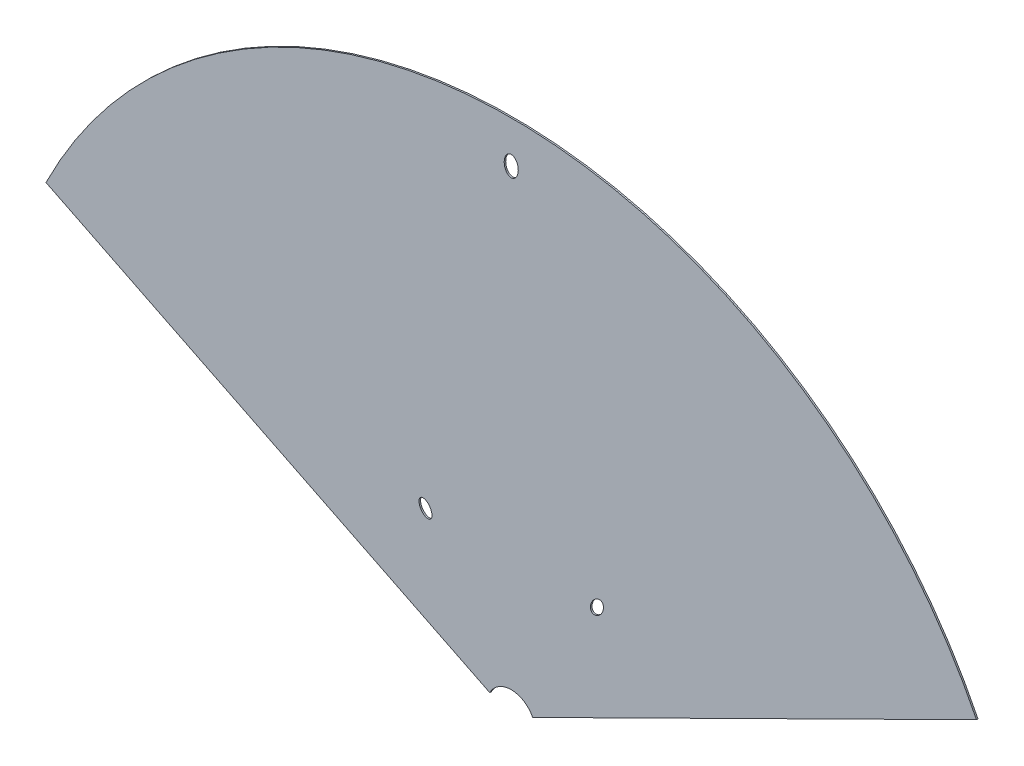
ISO-10303-21;
HEADER;
FILE_DESCRIPTION(('STEP AP214'),'2;1');
FILE_NAME('part.step','',(''),(''),'','','');
FILE_SCHEMA(('AUTOMOTIVE_DESIGN { 1 0 10303 214 1 1 1 1 }'));
ENDSEC;
DATA;
#1=APPLICATION_CONTEXT('core data for automotive mechanical design processes');
#2=APPLICATION_PROTOCOL_DEFINITION('international standard','automotive_design',2000,#1);
#3=PRODUCT_CONTEXT('',#1,'mechanical');
#4=PRODUCT('Part','Part','',(#3));
#5=PRODUCT_RELATED_PRODUCT_CATEGORY('part','',(#4));
#6=PRODUCT_DEFINITION_FORMATION('','',#4);
#7=PRODUCT_DEFINITION_CONTEXT('part definition',#1,'design');
#8=PRODUCT_DEFINITION('design','',#6,#7);
#9=PRODUCT_DEFINITION_SHAPE('','',#8);
#10=(LENGTH_UNIT() NAMED_UNIT(*) SI_UNIT(.MILLI.,.METRE.));
#11=(NAMED_UNIT(*) PLANE_ANGLE_UNIT() SI_UNIT($,.RADIAN.));
#12=(NAMED_UNIT(*) SI_UNIT($,.STERADIAN.) SOLID_ANGLE_UNIT());
#13=UNCERTAINTY_MEASURE_WITH_UNIT(LENGTH_MEASURE(1.E-05),#10,'distance_accuracy_value','');
#14=(GEOMETRIC_REPRESENTATION_CONTEXT(3) GLOBAL_UNCERTAINTY_ASSIGNED_CONTEXT((#13)) GLOBAL_UNIT_ASSIGNED_CONTEXT((#10,
#11,#12)) REPRESENTATION_CONTEXT('',''));
#15=CARTESIAN_POINT('',(0.,0.,0.));
#16=DIRECTION('',(0.,0.,1.));
#17=DIRECTION('',(1.,0.,0.));
#18=AXIS2_PLACEMENT_3D('',#15,#16,#17);
#19=CARTESIAN_POINT('',(98735.5249050137,8318.62947994032,5.));
#20=DIRECTION('',(0.,0.,1.));
#21=DIRECTION('',(1.,0.,0.));
#22=AXIS2_PLACEMENT_3D('',#19,#20,#21);
#23=CYLINDRICAL_SURFACE('',#22,1699.55627484778);
#24=DIRECTION('',(0.,0.,1.));
#25=VECTOR('',#24,1.);
#26=CARTESIAN_POINT('',(100258.364642478,9073.24903002874,5.));
#27=LINE('',#26,#25);
#28=CARTESIAN_POINT('',(100258.364642478,9073.24903002874,0.));
#29=VERTEX_POINT('',#28);
#30=CARTESIAN_POINT('',(100258.364642478,9073.24903002874,5.));
#31=VERTEX_POINT('',#30);
#32=EDGE_CURVE('E11',#29,#31,#27,.T.);
#33=ORIENTED_EDGE('',*,*,#32,.F.);
#34=CARTESIAN_POINT('',(98735.5249050137,8318.62947994032,0.));
#35=DIRECTION('',(0.,0.,1.));
#36=DIRECTION('',(1.,0.,0.));
#37=AXIS2_PLACEMENT_3D('',#34,#35,#36);
#38=CIRCLE('',#37,1699.55627484778);
#39=CARTESIAN_POINT('',(97212.6851675499,9073.24903002874,0.));
#40=VERTEX_POINT('',#39);
#41=EDGE_CURVE('E94',#29,#40,#38,.T.);
#42=ORIENTED_EDGE('',*,*,#41,.T.);
#43=DIRECTION('',(0.,0.,1.));
#44=VECTOR('',#43,1.);
#45=CARTESIAN_POINT('',(97212.6851675499,9073.24903002874,5.));
#46=LINE('',#45,#44);
#47=CARTESIAN_POINT('',(97212.6851675499,9073.24903002874,5.));
#48=VERTEX_POINT('',#47);
#49=EDGE_CURVE('E48',#40,#48,#46,.T.);
#50=ORIENTED_EDGE('',*,*,#49,.T.);
#51=CARTESIAN_POINT('',(98735.5249050137,8318.62947994032,5.));
#52=DIRECTION('',(0.,0.,1.));
#53=DIRECTION('',(1.,0.,0.));
#54=AXIS2_PLACEMENT_3D('',#51,#52,#53);
#55=CIRCLE('',#54,1699.55627484778);
#56=EDGE_CURVE('E114',#31,#48,#55,.T.);
#57=ORIENTED_EDGE('',*,*,#56,.F.);
#58=EDGE_LOOP('',(#33,#42,#50,#57));
#59=FACE_BOUND('',#58,.T.);
#60=ADVANCED_FACE('F37',(#59),#23,.T.);
#61=CARTESIAN_POINT('',(98665.3464000207,8353.40534673762,5.));
#62=DIRECTION('',(-0.444009746106229,-0.896021955848562,0.));
#63=DIRECTION('',(0.896021955848562,-0.444009746106229,0.));
#64=AXIS2_PLACEMENT_3D('',#61,#62,#63);
#65=PLANE('',#64);
#66=ORIENTED_EDGE('',*,*,#49,.F.);
#67=DIRECTION('',(0.896021955848562,-0.444009746106229,0.));
#68=VECTOR('',#67,1.);
#69=CARTESIAN_POINT('',(98665.3464000207,8353.40534673762,0.));
#70=LINE('',#69,#68);
#71=CARTESIAN_POINT('',(98665.3464000207,8353.40534673762,0.));
#72=VERTEX_POINT('',#71);
#73=EDGE_CURVE('E102',#40,#72,#70,.T.);
#74=ORIENTED_EDGE('',*,*,#73,.T.);
#75=DIRECTION('',(0.,0.,1.));
#76=VECTOR('',#75,1.);
#77=CARTESIAN_POINT('',(98665.3464000207,8353.40534673762,5.));
#78=LINE('',#77,#76);
#79=CARTESIAN_POINT('',(98665.3464000207,8353.40534673762,5.));
#80=VERTEX_POINT('',#79);
#81=EDGE_CURVE('E56',#72,#80,#78,.T.);
#82=ORIENTED_EDGE('',*,*,#81,.T.);
#83=DIRECTION('',(0.896021955848562,-0.444009746106229,0.));
#84=VECTOR('',#83,1.);
#85=CARTESIAN_POINT('',(98665.3464000207,8353.40534673762,5.));
#86=LINE('',#85,#84);
#87=EDGE_CURVE('E119',#48,#80,#86,.T.);
#88=ORIENTED_EDGE('',*,*,#87,.F.);
#89=EDGE_LOOP('',(#66,#74,#82,#88));
#90=FACE_BOUND('',#89,.T.);
#91=ADVANCED_FACE('F121',(#90),#65,.T.);
#92=CARTESIAN_POINT('',(98735.5249050137,8318.62947994032,5.));
#93=DIRECTION('',(0.,0.,-1.));
#94=DIRECTION('',(-1.,0.,0.));
#95=AXIS2_PLACEMENT_3D('',#92,#93,#94);
#96=CYLINDRICAL_SURFACE('',#95,78.3223050896136);
#97=ORIENTED_EDGE('',*,*,#81,.F.);
#98=CARTESIAN_POINT('',(98735.5249050137,8318.62947994032,0.));
#99=DIRECTION('',(0.,0.,-1.));
#100=DIRECTION('',(-1.,0.,0.));
#101=AXIS2_PLACEMENT_3D('',#98,#99,#100);
#102=CIRCLE('',#101,78.3223050896136);
#103=CARTESIAN_POINT('',(98805.7034100067,8353.40534673762,0.));
#104=VERTEX_POINT('',#103);
#105=EDGE_CURVE('E93',#72,#104,#102,.T.);
#106=ORIENTED_EDGE('',*,*,#105,.T.);
#107=DIRECTION('',(0.,0.,1.));
#108=VECTOR('',#107,1.);
#109=CARTESIAN_POINT('',(98805.7034100067,8353.40534673762,5.));
#110=LINE('',#109,#108);
#111=CARTESIAN_POINT('',(98805.7034100067,8353.40534673762,5.));
#112=VERTEX_POINT('',#111);
#113=EDGE_CURVE('E42',#104,#112,#110,.T.);
#114=ORIENTED_EDGE('',*,*,#113,.T.);
#115=CARTESIAN_POINT('',(98735.5249050137,8318.62947994032,5.));
#116=DIRECTION('',(0.,0.,-1.));
#117=DIRECTION('',(1.,0.,0.));
#118=AXIS2_PLACEMENT_3D('',#115,#116,#117);
#119=CIRCLE('',#118,78.3223050896136);
#120=EDGE_CURVE('E150',#80,#112,#119,.T.);
#121=ORIENTED_EDGE('',*,*,#120,.F.);
#122=EDGE_LOOP('',(#97,#106,#114,#121));
#123=FACE_BOUND('',#122,.T.);
#124=ADVANCED_FACE('F96',(#123),#96,.F.);
#125=CARTESIAN_POINT('',(99016.1931349281,8770.94837321438,5.));
#126=DIRECTION('',(0.,0.,1.));
#127=DIRECTION('',(0.52725243190216,0.849708698939382,0.));
#128=AXIS2_PLACEMENT_3D('',#125,#126,#127);
#129=ELLIPSE('',#128,27.9999999999978,18.0000000000058);
#130=DIRECTION('',(0.,0.,1.));
#131=VECTOR('',#130,1.);
#132=SURFACE_OF_LINEAR_EXTRUSION('',#129,#131);
#133=CARTESIAN_POINT('',(99030.9562030213,8794.74021678468,5.));
#134=VERTEX_POINT('',#133);
#135=EDGE_CURVE('E111',#134,#134,#129,.T.);
#136=ORIENTED_EDGE('',*,*,#135,.T.);
#137=EDGE_LOOP('',(#136));
#138=FACE_BOUND('',#137,.T.);
#139=CARTESIAN_POINT('',(99016.1931349281,8770.94837321438,0.));
#140=DIRECTION('',(0.,0.,1.));
#141=DIRECTION('',(0.52725243190216,0.849708698939382,0.));
#142=AXIS2_PLACEMENT_3D('',#139,#140,#141);
#143=ELLIPSE('',#142,27.9999999999978,18.0000000000058);
#144=CARTESIAN_POINT('',(99030.9562030213,8794.74021678468,0.));
#145=VERTEX_POINT('',#144);
#146=EDGE_CURVE('E97',#145,#145,#143,.T.);
#147=ORIENTED_EDGE('',*,*,#146,.F.);
#148=EDGE_LOOP('',(#147));
#149=FACE_BOUND('',#148,.T.);
#150=ADVANCED_FACE('F135',(#138,#149),#132,.F.);
#151=CARTESIAN_POINT('',(100258.364642478,9073.24903002874,5.));
#152=DIRECTION('',(0.444009746106232,-0.89602195584856,0.));
#153=DIRECTION('',(0.89602195584856,0.444009746106232,0.));
#154=AXIS2_PLACEMENT_3D('',#151,#152,#153);
#155=PLANE('',#154);
#156=DIRECTION('',(0.89602195584856,0.444009746106232,0.));
#157=VECTOR('',#156,1.);
#158=CARTESIAN_POINT('',(100258.364642478,9073.24903002874,0.));
#159=LINE('',#158,#157);
#160=EDGE_CURVE('E81',#104,#29,#159,.T.);
#161=ORIENTED_EDGE('',*,*,#160,.T.);
#162=ORIENTED_EDGE('',*,*,#32,.T.);
#163=DIRECTION('',(0.89602195584856,0.444009746106232,0.));
#164=VECTOR('',#163,1.);
#165=CARTESIAN_POINT('',(100258.364642478,9073.24903002874,5.));
#166=LINE('',#165,#164);
#167=EDGE_CURVE('E83',#112,#31,#166,.T.);
#168=ORIENTED_EDGE('',*,*,#167,.F.);
#169=ORIENTED_EDGE('',*,*,#113,.F.);
#170=EDGE_LOOP('',(#161,#162,#168,#169));
#171=FACE_BOUND('',#170,.T.);
#172=ADVANCED_FACE('F80',(#171),#155,.T.);
#173=CARTESIAN_POINT('',(98454.8566750993,8770.94837321438,5.));
#174=DIRECTION('',(0.,0.,1.));
#175=DIRECTION('',(-0.52725243190216,0.849708698939382,0.));
#176=AXIS2_PLACEMENT_3D('',#173,#174,#175);
#177=ELLIPSE('',#176,27.9999999999978,18.0000000000058);
#178=DIRECTION('',(0.,0.,1.));
#179=VECTOR('',#178,1.);
#180=SURFACE_OF_LINEAR_EXTRUSION('',#177,#179);
#181=CARTESIAN_POINT('',(98440.0936070061,8794.74021678468,5.));
#182=VERTEX_POINT('',#181);
#183=EDGE_CURVE('E122',#182,#182,#177,.T.);
#184=ORIENTED_EDGE('',*,*,#183,.T.);
#185=EDGE_LOOP('',(#184));
#186=FACE_BOUND('',#185,.T.);
#187=CARTESIAN_POINT('',(98454.8566750993,8770.94837321438,0.));
#188=DIRECTION('',(0.,0.,1.));
#189=DIRECTION('',(-0.52725243190216,0.849708698939382,0.));
#190=AXIS2_PLACEMENT_3D('',#187,#188,#189);
#191=ELLIPSE('',#190,27.9999999999978,18.0000000000058);
#192=CARTESIAN_POINT('',(98440.0936070061,8794.74021678468,0.));
#193=VERTEX_POINT('',#192);
#194=EDGE_CURVE('E104',#193,#193,#191,.T.);
#195=ORIENTED_EDGE('',*,*,#194,.F.);
#196=EDGE_LOOP('',(#195));
#197=FACE_BOUND('',#196,.T.);
#198=ADVANCED_FACE('F129',(#186,#197),#180,.F.);
#199=CARTESIAN_POINT('',(98735.5249050137,9881.1857547881,5.));
#200=DIRECTION('',(0.,0.,1.));
#201=DIRECTION('',(0.,1.,0.));
#202=AXIS2_PLACEMENT_3D('',#199,#200,#201);
#203=ELLIPSE('',#202,32.9999999999995,22.9999999999961);
#204=DIRECTION('',(0.,0.,1.));
#205=VECTOR('',#204,1.);
#206=SURFACE_OF_LINEAR_EXTRUSION('',#203,#205);
#207=CARTESIAN_POINT('',(98735.5249050137,9914.1857547881,5.));
#208=VERTEX_POINT('',#207);
#209=EDGE_CURVE('E87',#208,#208,#203,.T.);
#210=ORIENTED_EDGE('',*,*,#209,.T.);
#211=EDGE_LOOP('',(#210));
#212=FACE_BOUND('',#211,.T.);
#213=CARTESIAN_POINT('',(98735.5249050137,9881.1857547881,0.));
#214=DIRECTION('',(0.,0.,1.));
#215=DIRECTION('',(0.,1.,0.));
#216=AXIS2_PLACEMENT_3D('',#213,#214,#215);
#217=ELLIPSE('',#216,32.9999999999995,22.9999999999961);
#218=CARTESIAN_POINT('',(98735.5249050137,9914.1857547881,0.));
#219=VERTEX_POINT('',#218);
#220=EDGE_CURVE('E108',#219,#219,#217,.T.);
#221=ORIENTED_EDGE('',*,*,#220,.F.);
#222=EDGE_LOOP('',(#221));
#223=FACE_BOUND('',#222,.T.);
#224=ADVANCED_FACE('F39',(#212,#223),#206,.F.);
#225=CARTESIAN_POINT('',(98735.5249050137,8318.62947994032,5.));
#226=DIRECTION('',(0.,0.,1.));
#227=DIRECTION('',(1.,0.,0.));
#228=AXIS2_PLACEMENT_3D('',#225,#226,#227);
#229=PLANE('',#228);
#230=ORIENTED_EDGE('',*,*,#135,.F.);
#231=EDGE_LOOP('',(#230));
#232=FACE_BOUND('',#231,.T.);
#233=ORIENTED_EDGE('',*,*,#120,.T.);
#234=ORIENTED_EDGE('',*,*,#167,.T.);
#235=ORIENTED_EDGE('',*,*,#56,.T.);
#236=ORIENTED_EDGE('',*,*,#87,.T.);
#237=EDGE_LOOP('',(#233,#234,#235,#236));
#238=FACE_BOUND('',#237,.T.);
#239=ORIENTED_EDGE('',*,*,#183,.F.);
#240=EDGE_LOOP('',(#239));
#241=FACE_BOUND('',#240,.T.);
#242=ORIENTED_EDGE('',*,*,#209,.F.);
#243=EDGE_LOOP('',(#242));
#244=FACE_BOUND('',#243,.T.);
#245=ADVANCED_FACE('F117',(#232,#238,#241,#244),#229,.T.);
#246=CARTESIAN_POINT('',(98735.5249050137,8318.62947994032,0.));
#247=DIRECTION('',(0.,0.,1.));
#248=DIRECTION('',(1.,0.,0.));
#249=AXIS2_PLACEMENT_3D('',#246,#247,#248);
#250=PLANE('',#249);
#251=ORIENTED_EDGE('',*,*,#146,.T.);
#252=EDGE_LOOP('',(#251));
#253=FACE_BOUND('',#252,.T.);
#254=ORIENTED_EDGE('',*,*,#105,.F.);
#255=ORIENTED_EDGE('',*,*,#73,.F.);
#256=ORIENTED_EDGE('',*,*,#41,.F.);
#257=ORIENTED_EDGE('',*,*,#160,.F.);
#258=EDGE_LOOP('',(#254,#255,#256,#257));
#259=FACE_BOUND('',#258,.T.);
#260=ORIENTED_EDGE('',*,*,#194,.T.);
#261=EDGE_LOOP('',(#260));
#262=FACE_BOUND('',#261,.T.);
#263=ORIENTED_EDGE('',*,*,#220,.T.);
#264=EDGE_LOOP('',(#263));
#265=FACE_BOUND('',#264,.T.);
#266=ADVANCED_FACE('F90',(#253,#259,#262,#265),#250,.F.);
#267=CLOSED_SHELL('',(#60,#91,#124,#150,#172,#198,#224,#245,#266));
#268=MANIFOLD_SOLID_BREP('B2',#267);
#269=ADVANCED_BREP_SHAPE_REPRESENTATION('',(#18,#268),#14);
#270=SHAPE_DEFINITION_REPRESENTATION(#9,#269);
ENDSEC;
END-ISO-10303-21;
